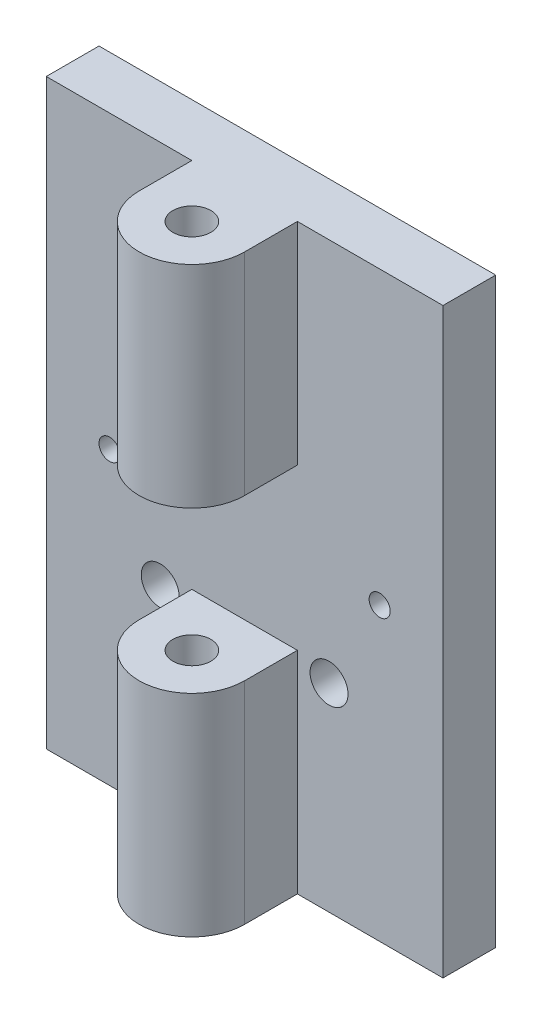
ISO-10303-21;
HEADER;
FILE_DESCRIPTION(('STEP AP214'),'2;1');
FILE_NAME('part.step','',(''),(''),'','','');
FILE_SCHEMA(('AUTOMOTIVE_DESIGN { 1 0 10303 214 1 1 1 1 }'));
ENDSEC;
DATA;
#1=APPLICATION_CONTEXT('core data for automotive mechanical design processes');
#2=APPLICATION_PROTOCOL_DEFINITION('international standard','automotive_design',2000,#1);
#3=PRODUCT_CONTEXT('',#1,'mechanical');
#4=PRODUCT('Part','Part','',(#3));
#5=PRODUCT_RELATED_PRODUCT_CATEGORY('part','',(#4));
#6=PRODUCT_DEFINITION_FORMATION('','',#4);
#7=PRODUCT_DEFINITION_CONTEXT('part definition',#1,'design');
#8=PRODUCT_DEFINITION('design','',#6,#7);
#9=PRODUCT_DEFINITION_SHAPE('','',#8);
#10=(LENGTH_UNIT() NAMED_UNIT(*) SI_UNIT(.MILLI.,.METRE.));
#11=(NAMED_UNIT(*) PLANE_ANGLE_UNIT() SI_UNIT($,.RADIAN.));
#12=(NAMED_UNIT(*) SI_UNIT($,.STERADIAN.) SOLID_ANGLE_UNIT());
#13=UNCERTAINTY_MEASURE_WITH_UNIT(LENGTH_MEASURE(1.E-05),#10,'distance_accuracy_value','');
#14=(GEOMETRIC_REPRESENTATION_CONTEXT(3) GLOBAL_UNCERTAINTY_ASSIGNED_CONTEXT((#13)) GLOBAL_UNIT_ASSIGNED_CONTEXT((#10,
#11,#12)) REPRESENTATION_CONTEXT('',''));
#15=CARTESIAN_POINT('',(0.,0.,0.));
#16=DIRECTION('',(0.,0.,1.));
#17=DIRECTION('',(1.,0.,0.));
#18=AXIS2_PLACEMENT_3D('',#15,#16,#17);
#19=CARTESIAN_POINT('',(3.175,0.,9.525));
#20=DIRECTION('',(-1.,0.,0.));
#21=DIRECTION('',(0.,0.,1.));
#22=AXIS2_PLACEMENT_3D('',#19,#20,#21);
#23=PLANE('',#22);
#24=DIRECTION('',(0.,-1.,0.));
#25=VECTOR('',#24,1.);
#26=CARTESIAN_POINT('',(3.175,49.53,6.35));
#27=LINE('',#26,#25);
#28=CARTESIAN_POINT('',(3.175,35.052,6.35));
#29=VERTEX_POINT('',#28);
#30=CARTESIAN_POINT('',(3.175,22.352,6.35));
#31=VERTEX_POINT('',#30);
#32=EDGE_CURVE('E148',#29,#31,#27,.T.);
#33=ORIENTED_EDGE('',*,*,#32,.T.);
#34=DIRECTION('',(0.,0.,-1.));
#35=VECTOR('',#34,1.);
#36=CARTESIAN_POINT('',(3.175,22.352,9.525));
#37=LINE('',#36,#35);
#38=CARTESIAN_POINT('',(3.175,22.352,3.175));
#39=VERTEX_POINT('',#38);
#40=EDGE_CURVE('E233',#31,#39,#37,.T.);
#41=ORIENTED_EDGE('',*,*,#40,.T.);
#42=DIRECTION('',(0.,1.,0.));
#43=VECTOR('',#42,1.);
#44=CARTESIAN_POINT('',(3.175,0.,3.175));
#45=LINE('',#44,#43);
#46=CARTESIAN_POINT('',(3.175,35.052,3.175));
#47=VERTEX_POINT('',#46);
#48=EDGE_CURVE('E253',#39,#47,#45,.T.);
#49=ORIENTED_EDGE('',*,*,#48,.T.);
#50=DIRECTION('',(0.,0.,-1.));
#51=VECTOR('',#50,1.);
#52=CARTESIAN_POINT('',(3.175,35.052,9.525));
#53=LINE('',#52,#51);
#54=EDGE_CURVE('E162',#29,#47,#53,.T.);
#55=ORIENTED_EDGE('',*,*,#54,.F.);
#56=EDGE_LOOP('',(#33,#41,#49,#55));
#57=FACE_BOUND('',#56,.T.);
#58=ADVANCED_FACE('F49',(#57),#23,.F.);
#59=CARTESIAN_POINT('',(3.175,12.7,6.35));
#60=VERTEX_POINT('',#59);
#61=CARTESIAN_POINT('',(3.175,0.,6.35));
#62=VERTEX_POINT('',#61);
#63=EDGE_CURVE('E141',#60,#62,#27,.T.);
#64=ORIENTED_EDGE('',*,*,#63,.T.);
#65=DIRECTION('',(0.,0.,-1.));
#66=VECTOR('',#65,1.);
#67=CARTESIAN_POINT('',(3.175,0.,9.525));
#68=LINE('',#67,#66);
#69=CARTESIAN_POINT('',(3.175,0.,3.175));
#70=VERTEX_POINT('',#69);
#71=EDGE_CURVE('E153',#62,#70,#68,.T.);
#72=ORIENTED_EDGE('',*,*,#71,.T.);
#73=CARTESIAN_POINT('',(3.175,12.7,3.175));
#74=VERTEX_POINT('',#73);
#75=EDGE_CURVE('E254',#70,#74,#45,.T.);
#76=ORIENTED_EDGE('',*,*,#75,.T.);
#77=DIRECTION('',(0.,0.,1.));
#78=VECTOR('',#77,1.);
#79=CARTESIAN_POINT('',(3.175,12.7,9.525));
#80=LINE('',#79,#78);
#81=EDGE_CURVE('E155',#74,#60,#80,.T.);
#82=ORIENTED_EDGE('',*,*,#81,.T.);
#83=EDGE_LOOP('',(#64,#72,#76,#82));
#84=FACE_BOUND('',#83,.T.);
#85=ADVANCED_FACE('F151',(#84),#23,.F.);
#86=CARTESIAN_POINT('',(-3.175,0.,9.525));
#87=DIRECTION('',(1.,0.,0.));
#88=DIRECTION('',(0.,0.,-1.));
#89=AXIS2_PLACEMENT_3D('',#86,#87,#88);
#90=PLANE('',#89);
#91=DIRECTION('',(0.,0.,1.));
#92=VECTOR('',#91,1.);
#93=CARTESIAN_POINT('',(-3.175,22.352,9.525));
#94=LINE('',#93,#92);
#95=CARTESIAN_POINT('',(-3.175,22.352,3.175));
#96=VERTEX_POINT('',#95);
#97=CARTESIAN_POINT('',(-3.175,22.352,6.35));
#98=VERTEX_POINT('',#97);
#99=EDGE_CURVE('E237',#96,#98,#94,.T.);
#100=ORIENTED_EDGE('',*,*,#99,.T.);
#101=DIRECTION('',(0.,-1.,0.));
#102=VECTOR('',#101,1.);
#103=CARTESIAN_POINT('',(-3.175,49.53,6.35));
#104=LINE('',#103,#102);
#105=CARTESIAN_POINT('',(-3.175,35.052,6.35));
#106=VERTEX_POINT('',#105);
#107=EDGE_CURVE('E64',#106,#98,#104,.T.);
#108=ORIENTED_EDGE('',*,*,#107,.F.);
#109=DIRECTION('',(0.,0.,-1.));
#110=VECTOR('',#109,1.);
#111=CARTESIAN_POINT('',(-3.175,35.052,9.525));
#112=LINE('',#111,#110);
#113=CARTESIAN_POINT('',(-3.175,35.052,3.175));
#114=VERTEX_POINT('',#113);
#115=EDGE_CURVE('E71',#106,#114,#112,.T.);
#116=ORIENTED_EDGE('',*,*,#115,.T.);
#117=DIRECTION('',(0.,-1.,0.));
#118=VECTOR('',#117,1.);
#119=CARTESIAN_POINT('',(-3.175,0.,3.175));
#120=LINE('',#119,#118);
#121=EDGE_CURVE('E251',#114,#96,#120,.T.);
#122=ORIENTED_EDGE('',*,*,#121,.T.);
#123=EDGE_LOOP('',(#100,#108,#116,#122));
#124=FACE_BOUND('',#123,.T.);
#125=ADVANCED_FACE('F314',(#124),#90,.F.);
#126=CARTESIAN_POINT('',(0.,49.53,6.35));
#127=DIRECTION('',(0.,-1.,0.));
#128=DIRECTION('',(0.,0.,-1.));
#129=AXIS2_PLACEMENT_3D('',#126,#127,#128);
#130=CYLINDRICAL_SURFACE('',#129,1.143);
#131=CARTESIAN_POINT('',(0.,22.352,6.35));
#132=DIRECTION('',(0.,1.,0.));
#133=DIRECTION('',(0.,0.,1.));
#134=AXIS2_PLACEMENT_3D('',#131,#132,#133);
#135=CIRCLE('',#134,1.143);
#136=CARTESIAN_POINT('',(0.,22.352,7.493));
#137=VERTEX_POINT('',#136);
#138=EDGE_CURVE('E231',#137,#137,#135,.T.);
#139=ORIENTED_EDGE('',*,*,#138,.F.);
#140=EDGE_LOOP('',(#139));
#141=FACE_BOUND('',#140,.T.);
#142=CARTESIAN_POINT('',(0.,35.052,6.35));
#143=DIRECTION('',(0.,-1.,0.));
#144=DIRECTION('',(0.,0.,-1.));
#145=AXIS2_PLACEMENT_3D('',#142,#143,#144);
#146=CIRCLE('',#145,1.143);
#147=CARTESIAN_POINT('',(0.,35.052,5.207));
#148=VERTEX_POINT('',#147);
#149=EDGE_CURVE('E223',#148,#148,#146,.F.);
#150=ORIENTED_EDGE('',*,*,#149,.T.);
#151=EDGE_LOOP('',(#150));
#152=FACE_BOUND('',#151,.T.);
#153=ADVANCED_FACE('F338',(#141,#152),#130,.F.);
#154=CARTESIAN_POINT('',(0.,0.,3.175));
#155=DIRECTION('',(0.,0.,-1.));
#156=DIRECTION('',(-1.,0.,0.));
#157=AXIS2_PLACEMENT_3D('',#154,#155,#156);
#158=PLANE('',#157);
#159=CARTESIAN_POINT('',(-5.08,11.938,3.175));
#160=DIRECTION('',(0.,0.,1.));
#161=DIRECTION('',(1.,0.,0.));
#162=AXIS2_PLACEMENT_3D('',#159,#160,#161);
#163=CIRCLE('',#162,1.143);
#164=CARTESIAN_POINT('',(-3.937,11.938,3.175));
#165=VERTEX_POINT('',#164);
#166=EDGE_CURVE('E181',#165,#165,#163,.T.);
#167=ORIENTED_EDGE('',*,*,#166,.F.);
#168=EDGE_LOOP('',(#167));
#169=FACE_BOUND('',#168,.T.);
#170=CARTESIAN_POINT('',(5.08,11.938,3.175));
#171=DIRECTION('',(0.,0.,1.));
#172=DIRECTION('',(1.,0.,0.));
#173=AXIS2_PLACEMENT_3D('',#170,#171,#172);
#174=CIRCLE('',#173,1.143);
#175=CARTESIAN_POINT('',(6.223,11.938,3.175));
#176=VERTEX_POINT('',#175);
#177=EDGE_CURVE('E169',#176,#176,#174,.T.);
#178=ORIENTED_EDGE('',*,*,#177,.F.);
#179=EDGE_LOOP('',(#178));
#180=FACE_BOUND('',#179,.T.);
#181=DIRECTION('',(0.,1.,0.));
#182=VECTOR('',#181,1.);
#183=CARTESIAN_POINT('',(11.938,0.,3.175));
#184=LINE('',#183,#182);
#185=CARTESIAN_POINT('',(11.938,0.,3.175));
#186=VERTEX_POINT('',#185);
#187=CARTESIAN_POINT('',(11.938,35.052,3.175));
#188=VERTEX_POINT('',#187);
#189=EDGE_CURVE('E199',#186,#188,#184,.T.);
#190=ORIENTED_EDGE('',*,*,#189,.T.);
#191=DIRECTION('',(-1.,0.,0.));
#192=VECTOR('',#191,1.);
#193=CARTESIAN_POINT('',(-11.938,35.052,3.175));
#194=LINE('',#193,#192);
#195=EDGE_CURVE('E202',#188,#47,#194,.T.);
#196=ORIENTED_EDGE('',*,*,#195,.T.);
#197=ORIENTED_EDGE('',*,*,#48,.F.);
#198=DIRECTION('',(1.,0.,0.));
#199=VECTOR('',#198,1.);
#200=CARTESIAN_POINT('',(-24.765,22.352,3.175));
#201=LINE('',#200,#199);
#202=EDGE_CURVE('E230',#96,#39,#201,.T.);
#203=ORIENTED_EDGE('',*,*,#202,.F.);
#204=ORIENTED_EDGE('',*,*,#121,.F.);
#205=CARTESIAN_POINT('',(-11.938,35.052,3.175));
#206=VERTEX_POINT('',#205);
#207=EDGE_CURVE('E201',#114,#206,#194,.T.);
#208=ORIENTED_EDGE('',*,*,#207,.T.);
#209=DIRECTION('',(0.,-1.,0.));
#210=VECTOR('',#209,1.);
#211=CARTESIAN_POINT('',(-11.938,0.,3.175));
#212=LINE('',#211,#210);
#213=CARTESIAN_POINT('',(-11.938,0.,3.175));
#214=VERTEX_POINT('',#213);
#215=EDGE_CURVE('E193',#206,#214,#212,.T.);
#216=ORIENTED_EDGE('',*,*,#215,.T.);
#217=DIRECTION('',(1.,0.,0.));
#218=VECTOR('',#217,1.);
#219=CARTESIAN_POINT('',(-11.938,0.,3.175));
#220=LINE('',#219,#218);
#221=CARTESIAN_POINT('',(-3.175,0.,3.175));
#222=VERTEX_POINT('',#221);
#223=EDGE_CURVE('E196',#214,#222,#220,.T.);
#224=ORIENTED_EDGE('',*,*,#223,.T.);
#225=CARTESIAN_POINT('',(-3.175,12.7,3.175));
#226=VERTEX_POINT('',#225);
#227=EDGE_CURVE('E226',#226,#222,#120,.T.);
#228=ORIENTED_EDGE('',*,*,#227,.F.);
#229=DIRECTION('',(1.,0.,0.));
#230=VECTOR('',#229,1.);
#231=CARTESIAN_POINT('',(-24.765,12.7,3.175));
#232=LINE('',#231,#230);
#233=EDGE_CURVE('E275',#226,#74,#232,.T.);
#234=ORIENTED_EDGE('',*,*,#233,.T.);
#235=ORIENTED_EDGE('',*,*,#75,.F.);
#236=EDGE_CURVE('E160',#70,#186,#220,.T.);
#237=ORIENTED_EDGE('',*,*,#236,.T.);
#238=EDGE_LOOP('',(#190,#196,#197,#203,#204,#208,#216,#224,#228,#234,#235,#237));
#239=FACE_BOUND('',#238,.T.);
#240=CARTESIAN_POINT('',(8.128,17.526,3.175));
#241=DIRECTION('',(0.,0.,1.));
#242=DIRECTION('',(1.,0.,0.));
#243=AXIS2_PLACEMENT_3D('',#240,#241,#242);
#244=CIRCLE('',#243,0.635);
#245=CARTESIAN_POINT('',(8.763,17.526,3.175));
#246=VERTEX_POINT('',#245);
#247=EDGE_CURVE('E175',#246,#246,#244,.T.);
#248=ORIENTED_EDGE('',*,*,#247,.F.);
#249=EDGE_LOOP('',(#248));
#250=FACE_BOUND('',#249,.T.);
#251=CARTESIAN_POINT('',(-8.128,17.526,3.175));
#252=DIRECTION('',(0.,0.,1.));
#253=DIRECTION('',(1.,0.,0.));
#254=AXIS2_PLACEMENT_3D('',#251,#252,#253);
#255=CIRCLE('',#254,0.635);
#256=CARTESIAN_POINT('',(-7.493,17.526,3.175));
#257=VERTEX_POINT('',#256);
#258=EDGE_CURVE('E187',#257,#257,#255,.T.);
#259=ORIENTED_EDGE('',*,*,#258,.F.);
#260=EDGE_LOOP('',(#259));
#261=FACE_BOUND('',#260,.T.);
#262=ADVANCED_FACE('F265',(#169,#180,#239,#250,#261),#158,.F.);
#263=CARTESIAN_POINT('',(0.,0.,0.));
#264=DIRECTION('',(0.,0.,-1.));
#265=DIRECTION('',(-1.,0.,0.));
#266=AXIS2_PLACEMENT_3D('',#263,#264,#265);
#267=PLANE('',#266);
#268=CARTESIAN_POINT('',(8.128,17.526,0.));
#269=DIRECTION('',(0.,0.,1.));
#270=DIRECTION('',(1.,0.,0.));
#271=AXIS2_PLACEMENT_3D('',#268,#269,#270);
#272=CIRCLE('',#271,0.635);
#273=CARTESIAN_POINT('',(8.763,17.526,0.));
#274=VERTEX_POINT('',#273);
#275=EDGE_CURVE('E172',#274,#274,#272,.T.);
#276=ORIENTED_EDGE('',*,*,#275,.T.);
#277=EDGE_LOOP('',(#276));
#278=FACE_BOUND('',#277,.T.);
#279=CARTESIAN_POINT('',(-8.128,17.526,0.));
#280=DIRECTION('',(0.,0.,1.));
#281=DIRECTION('',(1.,0.,0.));
#282=AXIS2_PLACEMENT_3D('',#279,#280,#281);
#283=CIRCLE('',#282,0.635);
#284=CARTESIAN_POINT('',(-7.493,17.526,0.));
#285=VERTEX_POINT('',#284);
#286=EDGE_CURVE('E184',#285,#285,#283,.T.);
#287=ORIENTED_EDGE('',*,*,#286,.T.);
#288=EDGE_LOOP('',(#287));
#289=FACE_BOUND('',#288,.T.);
#290=DIRECTION('',(0.,-1.,0.));
#291=VECTOR('',#290,1.);
#292=CARTESIAN_POINT('',(-11.938,0.,0.));
#293=LINE('',#292,#291);
#294=CARTESIAN_POINT('',(-11.938,35.052,0.));
#295=VERTEX_POINT('',#294);
#296=CARTESIAN_POINT('',(-11.938,0.,0.));
#297=VERTEX_POINT('',#296);
#298=EDGE_CURVE('E190',#295,#297,#293,.T.);
#299=ORIENTED_EDGE('',*,*,#298,.F.);
#300=DIRECTION('',(-1.,0.,0.));
#301=VECTOR('',#300,1.);
#302=CARTESIAN_POINT('',(-11.938,35.052,0.));
#303=LINE('',#302,#301);
#304=CARTESIAN_POINT('',(11.938,35.052,0.));
#305=VERTEX_POINT('',#304);
#306=EDGE_CURVE('E195',#305,#295,#303,.T.);
#307=ORIENTED_EDGE('',*,*,#306,.F.);
#308=DIRECTION('',(0.,1.,0.));
#309=VECTOR('',#308,1.);
#310=CARTESIAN_POINT('',(11.938,0.,0.));
#311=LINE('',#310,#309);
#312=CARTESIAN_POINT('',(11.938,0.,0.));
#313=VERTEX_POINT('',#312);
#314=EDGE_CURVE('E210',#313,#305,#311,.T.);
#315=ORIENTED_EDGE('',*,*,#314,.F.);
#316=DIRECTION('',(1.,0.,0.));
#317=VECTOR('',#316,1.);
#318=CARTESIAN_POINT('',(-11.938,0.,0.));
#319=LINE('',#318,#317);
#320=EDGE_CURVE('E208',#297,#313,#319,.T.);
#321=ORIENTED_EDGE('',*,*,#320,.F.);
#322=EDGE_LOOP('',(#299,#307,#315,#321));
#323=FACE_BOUND('',#322,.T.);
#324=CARTESIAN_POINT('',(-5.08,11.938,0.));
#325=DIRECTION('',(0.,0.,1.));
#326=DIRECTION('',(1.,0.,0.));
#327=AXIS2_PLACEMENT_3D('',#324,#325,#326);
#328=CIRCLE('',#327,1.143);
#329=CARTESIAN_POINT('',(-3.937,11.938,0.));
#330=VERTEX_POINT('',#329);
#331=EDGE_CURVE('E178',#330,#330,#328,.T.);
#332=ORIENTED_EDGE('',*,*,#331,.T.);
#333=EDGE_LOOP('',(#332));
#334=FACE_BOUND('',#333,.T.);
#335=CARTESIAN_POINT('',(5.08,11.938,0.));
#336=DIRECTION('',(0.,0.,1.));
#337=DIRECTION('',(1.,0.,0.));
#338=AXIS2_PLACEMENT_3D('',#335,#336,#337);
#339=CIRCLE('',#338,1.143);
#340=CARTESIAN_POINT('',(6.223,11.938,0.));
#341=VERTEX_POINT('',#340);
#342=EDGE_CURVE('E164',#341,#341,#339,.T.);
#343=ORIENTED_EDGE('',*,*,#342,.T.);
#344=EDGE_LOOP('',(#343));
#345=FACE_BOUND('',#344,.T.);
#346=ADVANCED_FACE('F294',(#278,#289,#323,#334,#345),#267,.T.);
#347=CARTESIAN_POINT('',(-11.938,0.,3.175));
#348=DIRECTION('',(1.,0.,0.));
#349=DIRECTION('',(0.,0.,-1.));
#350=AXIS2_PLACEMENT_3D('',#347,#348,#349);
#351=PLANE('',#350);
#352=ORIENTED_EDGE('',*,*,#298,.T.);
#353=DIRECTION('',(0.,0.,-1.));
#354=VECTOR('',#353,1.);
#355=CARTESIAN_POINT('',(-11.938,0.,3.175));
#356=LINE('',#355,#354);
#357=EDGE_CURVE('E57',#214,#297,#356,.T.);
#358=ORIENTED_EDGE('',*,*,#357,.F.);
#359=ORIENTED_EDGE('',*,*,#215,.F.);
#360=DIRECTION('',(0.,0.,-1.));
#361=VECTOR('',#360,1.);
#362=CARTESIAN_POINT('',(-11.938,35.052,3.175));
#363=LINE('',#362,#361);
#364=EDGE_CURVE('E205',#206,#295,#363,.T.);
#365=ORIENTED_EDGE('',*,*,#364,.T.);
#366=EDGE_LOOP('',(#352,#358,#359,#365));
#367=FACE_BOUND('',#366,.T.);
#368=ADVANCED_FACE('F51',(#367),#351,.F.);
#369=CARTESIAN_POINT('',(-11.938,0.,3.175));
#370=DIRECTION('',(0.,1.,0.));
#371=DIRECTION('',(0.,0.,1.));
#372=AXIS2_PLACEMENT_3D('',#369,#370,#371);
#373=PLANE('',#372);
#374=CARTESIAN_POINT('',(0.,0.,6.35));
#375=DIRECTION('',(0.,1.,0.));
#376=DIRECTION('',(0.,0.,1.));
#377=AXIS2_PLACEMENT_3D('',#374,#375,#376);
#378=CIRCLE('',#377,1.143);
#379=CARTESIAN_POINT('',(0.,0.,7.493));
#380=VERTEX_POINT('',#379);
#381=EDGE_CURVE('E227',#380,#380,#378,.T.);
#382=ORIENTED_EDGE('',*,*,#381,.T.);
#383=EDGE_LOOP('',(#382));
#384=FACE_BOUND('',#383,.T.);
#385=ORIENTED_EDGE('',*,*,#71,.F.);
#386=CARTESIAN_POINT('',(0.,0.,6.35));
#387=DIRECTION('',(0.,1.,0.));
#388=DIRECTION('',(0.,0.,1.));
#389=AXIS2_PLACEMENT_3D('',#386,#387,#388);
#390=CIRCLE('',#389,3.175);
#391=CARTESIAN_POINT('',(-3.175,0.,6.35));
#392=VERTEX_POINT('',#391);
#393=EDGE_CURVE('E138',#392,#62,#390,.T.);
#394=ORIENTED_EDGE('',*,*,#393,.F.);
#395=DIRECTION('',(0.,0.,-1.));
#396=VECTOR('',#395,1.);
#397=CARTESIAN_POINT('',(-3.175,0.,9.525));
#398=LINE('',#397,#396);
#399=EDGE_CURVE('E161',#392,#222,#398,.T.);
#400=ORIENTED_EDGE('',*,*,#399,.T.);
#401=ORIENTED_EDGE('',*,*,#223,.F.);
#402=ORIENTED_EDGE('',*,*,#357,.T.);
#403=ORIENTED_EDGE('',*,*,#320,.T.);
#404=DIRECTION('',(0.,0.,-1.));
#405=VECTOR('',#404,1.);
#406=CARTESIAN_POINT('',(11.938,0.,3.175));
#407=LINE('',#406,#405);
#408=EDGE_CURVE('E218',#186,#313,#407,.T.);
#409=ORIENTED_EDGE('',*,*,#408,.F.);
#410=ORIENTED_EDGE('',*,*,#236,.F.);
#411=EDGE_LOOP('',(#385,#394,#400,#401,#402,#403,#409,#410));
#412=FACE_BOUND('',#411,.T.);
#413=ADVANCED_FACE('F158',(#384,#412),#373,.F.);
#414=CARTESIAN_POINT('',(11.938,0.,3.175));
#415=DIRECTION('',(-1.,0.,0.));
#416=DIRECTION('',(0.,0.,1.));
#417=AXIS2_PLACEMENT_3D('',#414,#415,#416);
#418=PLANE('',#417);
#419=ORIENTED_EDGE('',*,*,#314,.T.);
#420=DIRECTION('',(0.,0.,-1.));
#421=VECTOR('',#420,1.);
#422=CARTESIAN_POINT('',(11.938,35.052,3.175));
#423=LINE('',#422,#421);
#424=EDGE_CURVE('E215',#188,#305,#423,.T.);
#425=ORIENTED_EDGE('',*,*,#424,.F.);
#426=ORIENTED_EDGE('',*,*,#189,.F.);
#427=ORIENTED_EDGE('',*,*,#408,.T.);
#428=EDGE_LOOP('',(#419,#425,#426,#427));
#429=FACE_BOUND('',#428,.T.);
#430=ADVANCED_FACE('F298',(#429),#418,.F.);
#431=CARTESIAN_POINT('',(-11.938,35.052,3.175));
#432=DIRECTION('',(0.,-1.,0.));
#433=DIRECTION('',(0.,0.,-1.));
#434=AXIS2_PLACEMENT_3D('',#431,#432,#433);
#435=PLANE('',#434);
#436=ORIENTED_EDGE('',*,*,#149,.F.);
#437=EDGE_LOOP('',(#436));
#438=FACE_BOUND('',#437,.T.);
#439=CARTESIAN_POINT('',(0.,35.052,6.35));
#440=DIRECTION('',(0.,-1.,0.));
#441=DIRECTION('',(0.,0.,-1.));
#442=AXIS2_PLACEMENT_3D('',#439,#440,#441);
#443=CIRCLE('',#442,3.175);
#444=EDGE_CURVE('E272',#106,#29,#443,.F.);
#445=ORIENTED_EDGE('',*,*,#444,.T.);
#446=ORIENTED_EDGE('',*,*,#54,.T.);
#447=ORIENTED_EDGE('',*,*,#195,.F.);
#448=ORIENTED_EDGE('',*,*,#424,.T.);
#449=ORIENTED_EDGE('',*,*,#306,.T.);
#450=ORIENTED_EDGE('',*,*,#364,.F.);
#451=ORIENTED_EDGE('',*,*,#207,.F.);
#452=ORIENTED_EDGE('',*,*,#115,.F.);
#453=EDGE_LOOP('',(#445,#446,#447,#448,#449,#450,#451,#452));
#454=FACE_BOUND('',#453,.T.);
#455=ADVANCED_FACE('F270',(#438,#454),#435,.F.);
#456=CARTESIAN_POINT('',(-8.128,17.526,3.175));
#457=DIRECTION('',(0.,0.,-1.));
#458=DIRECTION('',(-1.,0.,0.));
#459=AXIS2_PLACEMENT_3D('',#456,#457,#458);
#460=CYLINDRICAL_SURFACE('',#459,0.635);
#461=ORIENTED_EDGE('',*,*,#258,.T.);
#462=EDGE_LOOP('',(#461));
#463=FACE_BOUND('',#462,.T.);
#464=ORIENTED_EDGE('',*,*,#286,.F.);
#465=EDGE_LOOP('',(#464));
#466=FACE_BOUND('',#465,.T.);
#467=ADVANCED_FACE('F305',(#463,#466),#460,.F.);
#468=CARTESIAN_POINT('',(-5.08,11.938,3.175));
#469=DIRECTION('',(0.,0.,-1.));
#470=DIRECTION('',(-1.,0.,0.));
#471=AXIS2_PLACEMENT_3D('',#468,#469,#470);
#472=CYLINDRICAL_SURFACE('',#471,1.143);
#473=ORIENTED_EDGE('',*,*,#166,.T.);
#474=EDGE_LOOP('',(#473));
#475=FACE_BOUND('',#474,.T.);
#476=ORIENTED_EDGE('',*,*,#331,.F.);
#477=EDGE_LOOP('',(#476));
#478=FACE_BOUND('',#477,.T.);
#479=ADVANCED_FACE('F328',(#475,#478),#472,.F.);
#480=CARTESIAN_POINT('',(8.128,17.526,3.175));
#481=DIRECTION('',(0.,0.,-1.));
#482=DIRECTION('',(-1.,0.,0.));
#483=AXIS2_PLACEMENT_3D('',#480,#481,#482);
#484=CYLINDRICAL_SURFACE('',#483,0.635);
#485=ORIENTED_EDGE('',*,*,#247,.T.);
#486=EDGE_LOOP('',(#485));
#487=FACE_BOUND('',#486,.T.);
#488=ORIENTED_EDGE('',*,*,#275,.F.);
#489=EDGE_LOOP('',(#488));
#490=FACE_BOUND('',#489,.T.);
#491=ADVANCED_FACE('F324',(#487,#490),#484,.F.);
#492=CARTESIAN_POINT('',(5.08,11.938,3.175));
#493=DIRECTION('',(0.,0.,-1.));
#494=DIRECTION('',(-1.,0.,0.));
#495=AXIS2_PLACEMENT_3D('',#492,#493,#494);
#496=CYLINDRICAL_SURFACE('',#495,1.143);
#497=ORIENTED_EDGE('',*,*,#177,.T.);
#498=EDGE_LOOP('',(#497));
#499=FACE_BOUND('',#498,.T.);
#500=ORIENTED_EDGE('',*,*,#342,.F.);
#501=EDGE_LOOP('',(#500));
#502=FACE_BOUND('',#501,.T.);
#503=ADVANCED_FACE('F321',(#499,#502),#496,.F.);
#504=ORIENTED_EDGE('',*,*,#399,.F.);
#505=CARTESIAN_POINT('',(-3.175,12.7,6.35));
#506=VERTEX_POINT('',#505);
#507=EDGE_CURVE('E144',#506,#392,#104,.T.);
#508=ORIENTED_EDGE('',*,*,#507,.F.);
#509=DIRECTION('',(0.,0.,-1.));
#510=VECTOR('',#509,1.);
#511=CARTESIAN_POINT('',(-3.175,12.7,9.525));
#512=LINE('',#511,#510);
#513=EDGE_CURVE('E234',#506,#226,#512,.T.);
#514=ORIENTED_EDGE('',*,*,#513,.T.);
#515=ORIENTED_EDGE('',*,*,#227,.T.);
#516=EDGE_LOOP('',(#504,#508,#514,#515));
#517=FACE_BOUND('',#516,.T.);
#518=ADVANCED_FACE('F286',(#517),#90,.F.);
#519=CARTESIAN_POINT('',(0.,12.7,6.35));
#520=DIRECTION('',(0.,-1.,0.));
#521=DIRECTION('',(0.,0.,-1.));
#522=AXIS2_PLACEMENT_3D('',#519,#520,#521);
#523=CIRCLE('',#522,1.143);
#524=CARTESIAN_POINT('',(0.,12.7,5.207));
#525=VERTEX_POINT('',#524);
#526=EDGE_CURVE('E228',#525,#525,#523,.T.);
#527=ORIENTED_EDGE('',*,*,#526,.F.);
#528=EDGE_LOOP('',(#527));
#529=FACE_BOUND('',#528,.T.);
#530=ORIENTED_EDGE('',*,*,#381,.F.);
#531=EDGE_LOOP('',(#530));
#532=FACE_BOUND('',#531,.T.);
#533=ADVANCED_FACE('F317',(#529,#532),#130,.F.);
#534=CARTESIAN_POINT('',(-24.765,22.352,9.525));
#535=DIRECTION('',(0.,1.,0.));
#536=DIRECTION('',(0.,0.,1.));
#537=AXIS2_PLACEMENT_3D('',#534,#535,#536);
#538=PLANE('',#537);
#539=ORIENTED_EDGE('',*,*,#138,.T.);
#540=EDGE_LOOP('',(#539));
#541=FACE_BOUND('',#540,.T.);
#542=ORIENTED_EDGE('',*,*,#40,.F.);
#543=CARTESIAN_POINT('',(0.,22.352,6.35));
#544=DIRECTION('',(0.,1.,0.));
#545=DIRECTION('',(0.,0.,1.));
#546=AXIS2_PLACEMENT_3D('',#543,#544,#545);
#547=CIRCLE('',#546,3.175);
#548=EDGE_CURVE('E276',#31,#98,#547,.F.);
#549=ORIENTED_EDGE('',*,*,#548,.T.);
#550=ORIENTED_EDGE('',*,*,#99,.F.);
#551=ORIENTED_EDGE('',*,*,#202,.T.);
#552=EDGE_LOOP('',(#542,#549,#550,#551));
#553=FACE_BOUND('',#552,.T.);
#554=ADVANCED_FACE('F384',(#541,#553),#538,.F.);
#555=CARTESIAN_POINT('',(-24.765,12.7,9.525));
#556=DIRECTION('',(0.,-1.,0.));
#557=DIRECTION('',(0.,0.,-1.));
#558=AXIS2_PLACEMENT_3D('',#555,#556,#557);
#559=PLANE('',#558);
#560=ORIENTED_EDGE('',*,*,#526,.T.);
#561=EDGE_LOOP('',(#560));
#562=FACE_BOUND('',#561,.T.);
#563=CARTESIAN_POINT('',(0.,12.7,6.35));
#564=DIRECTION('',(0.,-1.,0.));
#565=DIRECTION('',(0.,0.,-1.));
#566=AXIS2_PLACEMENT_3D('',#563,#564,#565);
#567=CIRCLE('',#566,3.175);
#568=EDGE_CURVE('E14',#506,#60,#567,.F.);
#569=ORIENTED_EDGE('',*,*,#568,.T.);
#570=ORIENTED_EDGE('',*,*,#81,.F.);
#571=ORIENTED_EDGE('',*,*,#233,.F.);
#572=ORIENTED_EDGE('',*,*,#513,.F.);
#573=EDGE_LOOP('',(#569,#570,#571,#572));
#574=FACE_BOUND('',#573,.T.);
#575=ADVANCED_FACE('F285',(#562,#574),#559,.F.);
#576=CARTESIAN_POINT('',(0.,49.53,6.35));
#577=DIRECTION('',(0.,-1.,0.));
#578=DIRECTION('',(0.,0.,-1.));
#579=AXIS2_PLACEMENT_3D('',#576,#577,#578);
#580=CYLINDRICAL_SURFACE('',#579,3.175);
#581=ORIENTED_EDGE('',*,*,#507,.T.);
#582=ORIENTED_EDGE('',*,*,#393,.T.);
#583=ORIENTED_EDGE('',*,*,#63,.F.);
#584=ORIENTED_EDGE('',*,*,#568,.F.);
#585=EDGE_LOOP('',(#581,#582,#583,#584));
#586=FACE_BOUND('',#585,.T.);
#587=ADVANCED_FACE('F140',(#586),#580,.T.);
#588=ORIENTED_EDGE('',*,*,#107,.T.);
#589=ORIENTED_EDGE('',*,*,#548,.F.);
#590=ORIENTED_EDGE('',*,*,#32,.F.);
#591=ORIENTED_EDGE('',*,*,#444,.F.);
#592=EDGE_LOOP('',(#588,#589,#590,#591));
#593=FACE_BOUND('',#592,.T.);
#594=ADVANCED_FACE('F278',(#593),#580,.T.);
#595=CLOSED_SHELL('',(#58,#85,#125,#153,#262,#346,#368,#413,#430,#455,#467,#479,#491,#503,#518,
#533,#554,#575,#587,#594));
#596=MANIFOLD_SOLID_BREP('B2',#595);
#597=ADVANCED_BREP_SHAPE_REPRESENTATION('',(#18,#596),#14);
#598=SHAPE_DEFINITION_REPRESENTATION(#9,#597);
ENDSEC;
END-ISO-10303-21;
